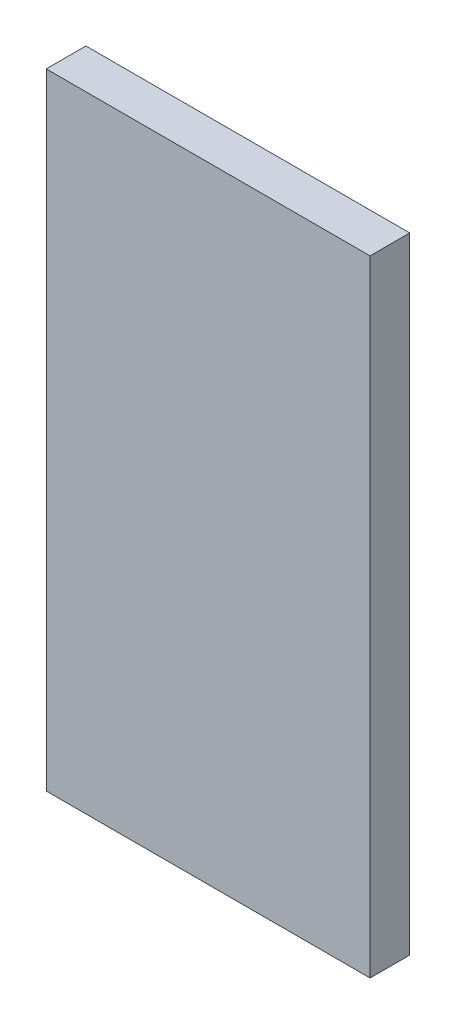
ISO-10303-21;
HEADER;
FILE_DESCRIPTION(('STEP AP214'),'2;1');
FILE_NAME('part.step','',(''),(''),'','','');
FILE_SCHEMA(('AUTOMOTIVE_DESIGN { 1 0 10303 214 1 1 1 1 }'));
ENDSEC;
DATA;
#1=APPLICATION_CONTEXT('core data for automotive mechanical design processes');
#2=APPLICATION_PROTOCOL_DEFINITION('international standard','automotive_design',2000,#1);
#3=PRODUCT_CONTEXT('',#1,'mechanical');
#4=PRODUCT('Part','Part','',(#3));
#5=PRODUCT_RELATED_PRODUCT_CATEGORY('part','',(#4));
#6=PRODUCT_DEFINITION_FORMATION('','',#4);
#7=PRODUCT_DEFINITION_CONTEXT('part definition',#1,'design');
#8=PRODUCT_DEFINITION('design','',#6,#7);
#9=PRODUCT_DEFINITION_SHAPE('','',#8);
#10=(LENGTH_UNIT() NAMED_UNIT(*) SI_UNIT(.MILLI.,.METRE.));
#11=(NAMED_UNIT(*) PLANE_ANGLE_UNIT() SI_UNIT($,.RADIAN.));
#12=(NAMED_UNIT(*) SI_UNIT($,.STERADIAN.) SOLID_ANGLE_UNIT());
#13=UNCERTAINTY_MEASURE_WITH_UNIT(LENGTH_MEASURE(1.E-05),#10,'distance_accuracy_value','');
#14=(GEOMETRIC_REPRESENTATION_CONTEXT(3) GLOBAL_UNCERTAINTY_ASSIGNED_CONTEXT((#13)) GLOBAL_UNIT_ASSIGNED_CONTEXT((#10,
#11,#12)) REPRESENTATION_CONTEXT('',''));
#15=CARTESIAN_POINT('',(0.,0.,0.));
#16=DIRECTION('',(0.,0.,1.));
#17=DIRECTION('',(1.,0.,0.));
#18=AXIS2_PLACEMENT_3D('',#15,#16,#17);
#19=CARTESIAN_POINT('',(-10.568,2.122,0.1));
#20=DIRECTION('',(0.,0.,1.));
#21=DIRECTION('',(1.,0.,0.));
#22=AXIS2_PLACEMENT_3D('',#19,#20,#21);
#23=PLANE('',#22);
#24=DIRECTION('',(0.,1.,0.));
#25=VECTOR('',#24,1.);
#26=CARTESIAN_POINT('',(-9.752,2.122,0.1));
#27=LINE('',#26,#25);
#28=CARTESIAN_POINT('',(-9.752,3.698,0.1));
#29=VERTEX_POINT('',#28);
#30=CARTESIAN_POINT('',(-9.752,2.122,0.1));
#31=VERTEX_POINT('',#30);
#32=EDGE_CURVE('E75',#29,#31,#27,.F.);
#33=ORIENTED_EDGE('',*,*,#32,.F.);
#34=DIRECTION('',(1.,0.,0.));
#35=VECTOR('',#34,1.);
#36=CARTESIAN_POINT('',(-10.568,3.698,0.1));
#37=LINE('',#36,#35);
#38=CARTESIAN_POINT('',(-10.568,3.698,0.1));
#39=VERTEX_POINT('',#38);
#40=EDGE_CURVE('E57',#39,#29,#37,.T.);
#41=ORIENTED_EDGE('',*,*,#40,.F.);
#42=DIRECTION('',(0.,1.,0.));
#43=VECTOR('',#42,1.);
#44=CARTESIAN_POINT('',(-10.568,2.122,0.1));
#45=LINE('',#44,#43);
#46=CARTESIAN_POINT('',(-10.568,2.122,0.1));
#47=VERTEX_POINT('',#46);
#48=EDGE_CURVE('E19',#39,#47,#45,.F.);
#49=ORIENTED_EDGE('',*,*,#48,.T.);
#50=DIRECTION('',(1.,0.,0.));
#51=VECTOR('',#50,1.);
#52=CARTESIAN_POINT('',(-10.568,2.122,0.1));
#53=LINE('',#52,#51);
#54=EDGE_CURVE('E54',#47,#31,#53,.T.);
#55=ORIENTED_EDGE('',*,*,#54,.T.);
#56=EDGE_LOOP('',(#33,#41,#49,#55));
#57=FACE_BOUND('',#56,.T.);
#58=ADVANCED_FACE('F16',(#57),#23,.T.);
#59=CARTESIAN_POINT('',(-10.568,2.122,0.));
#60=DIRECTION('',(1.,0.,0.));
#61=DIRECTION('',(0.,0.,-1.));
#62=AXIS2_PLACEMENT_3D('',#59,#60,#61);
#63=PLANE('',#62);
#64=DIRECTION('',(0.,0.,1.));
#65=VECTOR('',#64,1.);
#66=CARTESIAN_POINT('',(-10.568,3.698,0.));
#67=LINE('',#66,#65);
#68=CARTESIAN_POINT('',(-10.568,3.698,0.));
#69=VERTEX_POINT('',#68);
#70=EDGE_CURVE('E77',#69,#39,#67,.T.);
#71=ORIENTED_EDGE('',*,*,#70,.F.);
#72=DIRECTION('',(0.,1.,0.));
#73=VECTOR('',#72,1.);
#74=CARTESIAN_POINT('',(-10.568,2.122,0.));
#75=LINE('',#74,#73);
#76=CARTESIAN_POINT('',(-10.568,2.122,0.));
#77=VERTEX_POINT('',#76);
#78=EDGE_CURVE('E72',#69,#77,#75,.F.);
#79=ORIENTED_EDGE('',*,*,#78,.T.);
#80=DIRECTION('',(0.,0.,1.));
#81=VECTOR('',#80,1.);
#82=CARTESIAN_POINT('',(-10.568,2.122,0.));
#83=LINE('',#82,#81);
#84=EDGE_CURVE('E62',#77,#47,#83,.T.);
#85=ORIENTED_EDGE('',*,*,#84,.T.);
#86=ORIENTED_EDGE('',*,*,#48,.F.);
#87=EDGE_LOOP('',(#71,#79,#85,#86));
#88=FACE_BOUND('',#87,.T.);
#89=ADVANCED_FACE('F71',(#88),#63,.F.);
#90=CARTESIAN_POINT('',(-10.568,2.122,0.));
#91=DIRECTION('',(0.,1.,0.));
#92=DIRECTION('',(0.,0.,1.));
#93=AXIS2_PLACEMENT_3D('',#90,#91,#92);
#94=PLANE('',#93);
#95=ORIENTED_EDGE('',*,*,#54,.F.);
#96=ORIENTED_EDGE('',*,*,#84,.F.);
#97=DIRECTION('',(1.,0.,0.));
#98=VECTOR('',#97,1.);
#99=CARTESIAN_POINT('',(-10.568,2.122,0.));
#100=LINE('',#99,#98);
#101=CARTESIAN_POINT('',(-9.752,2.122,0.));
#102=VERTEX_POINT('',#101);
#103=EDGE_CURVE('E82',#77,#102,#100,.T.);
#104=ORIENTED_EDGE('',*,*,#103,.T.);
#105=DIRECTION('',(0.,0.,-1.));
#106=VECTOR('',#105,1.);
#107=CARTESIAN_POINT('',(-9.752,2.122,0.));
#108=LINE('',#107,#106);
#109=EDGE_CURVE('E68',#31,#102,#108,.T.);
#110=ORIENTED_EDGE('',*,*,#109,.F.);
#111=EDGE_LOOP('',(#95,#96,#104,#110));
#112=FACE_BOUND('',#111,.T.);
#113=ADVANCED_FACE('F65',(#112),#94,.F.);
#114=CARTESIAN_POINT('',(-9.752,2.122,0.));
#115=DIRECTION('',(1.,0.,0.));
#116=DIRECTION('',(0.,0.,-1.));
#117=AXIS2_PLACEMENT_3D('',#114,#115,#116);
#118=PLANE('',#117);
#119=DIRECTION('',(0.,0.,1.));
#120=VECTOR('',#119,1.);
#121=CARTESIAN_POINT('',(-9.752,3.698,0.));
#122=LINE('',#121,#120);
#123=CARTESIAN_POINT('',(-9.752,3.698,0.));
#124=VERTEX_POINT('',#123);
#125=EDGE_CURVE('E33',#29,#124,#122,.F.);
#126=ORIENTED_EDGE('',*,*,#125,.F.);
#127=ORIENTED_EDGE('',*,*,#32,.T.);
#128=ORIENTED_EDGE('',*,*,#109,.T.);
#129=DIRECTION('',(0.,1.,0.));
#130=VECTOR('',#129,1.);
#131=CARTESIAN_POINT('',(-9.752,2.122,0.));
#132=LINE('',#131,#130);
#133=EDGE_CURVE('E25',#102,#124,#132,.T.);
#134=ORIENTED_EDGE('',*,*,#133,.T.);
#135=EDGE_LOOP('',(#126,#127,#128,#134));
#136=FACE_BOUND('',#135,.T.);
#137=ADVANCED_FACE('F87',(#136),#118,.T.);
#138=CARTESIAN_POINT('',(-10.568,3.698,0.));
#139=DIRECTION('',(0.,1.,0.));
#140=DIRECTION('',(0.,0.,1.));
#141=AXIS2_PLACEMENT_3D('',#138,#139,#140);
#142=PLANE('',#141);
#143=ORIENTED_EDGE('',*,*,#40,.T.);
#144=ORIENTED_EDGE('',*,*,#125,.T.);
#145=DIRECTION('',(1.,0.,0.));
#146=VECTOR('',#145,1.);
#147=CARTESIAN_POINT('',(-10.568,3.698,0.));
#148=LINE('',#147,#146);
#149=EDGE_CURVE('E11',#124,#69,#148,.F.);
#150=ORIENTED_EDGE('',*,*,#149,.T.);
#151=ORIENTED_EDGE('',*,*,#70,.T.);
#152=EDGE_LOOP('',(#143,#144,#150,#151));
#153=FACE_BOUND('',#152,.T.);
#154=ADVANCED_FACE('F90',(#153),#142,.T.);
#155=CARTESIAN_POINT('',(-10.568,2.122,0.));
#156=DIRECTION('',(0.,0.,1.));
#157=DIRECTION('',(1.,0.,0.));
#158=AXIS2_PLACEMENT_3D('',#155,#156,#157);
#159=PLANE('',#158);
#160=ORIENTED_EDGE('',*,*,#133,.F.);
#161=ORIENTED_EDGE('',*,*,#103,.F.);
#162=ORIENTED_EDGE('',*,*,#78,.F.);
#163=ORIENTED_EDGE('',*,*,#149,.F.);
#164=EDGE_LOOP('',(#160,#161,#162,#163));
#165=FACE_BOUND('',#164,.T.);
#166=ADVANCED_FACE('F89',(#165),#159,.F.);
#167=CLOSED_SHELL('',(#58,#89,#113,#137,#154,#166));
#168=MANIFOLD_SOLID_BREP('B1',#167);
#169=ADVANCED_BREP_SHAPE_REPRESENTATION('',(#18,#168),#14);
#170=SHAPE_DEFINITION_REPRESENTATION(#9,#169);
ENDSEC;
END-ISO-10303-21;
